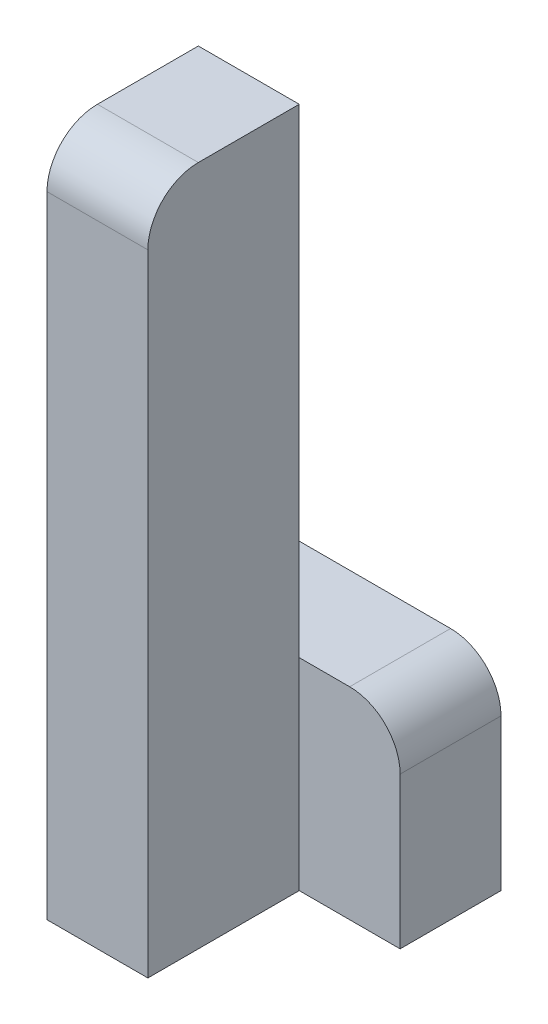
ISO-10303-21;
HEADER;
FILE_DESCRIPTION(('STEP AP214'),'2;1');
FILE_NAME('part.step','',(''),(''),'','','');
FILE_SCHEMA(('AUTOMOTIVE_DESIGN { 1 0 10303 214 1 1 1 1 }'));
ENDSEC;
DATA;
#1=APPLICATION_CONTEXT('core data for automotive mechanical design processes');
#2=APPLICATION_PROTOCOL_DEFINITION('international standard','automotive_design',2000,#1);
#3=PRODUCT_CONTEXT('',#1,'mechanical');
#4=PRODUCT('Part','Part','',(#3));
#5=PRODUCT_RELATED_PRODUCT_CATEGORY('part','',(#4));
#6=PRODUCT_DEFINITION_FORMATION('','',#4);
#7=PRODUCT_DEFINITION_CONTEXT('part definition',#1,'design');
#8=PRODUCT_DEFINITION('design','',#6,#7);
#9=PRODUCT_DEFINITION_SHAPE('','',#8);
#10=(LENGTH_UNIT() NAMED_UNIT(*) SI_UNIT(.MILLI.,.METRE.));
#11=(NAMED_UNIT(*) PLANE_ANGLE_UNIT() SI_UNIT($,.RADIAN.));
#12=(NAMED_UNIT(*) SI_UNIT($,.STERADIAN.) SOLID_ANGLE_UNIT());
#13=UNCERTAINTY_MEASURE_WITH_UNIT(LENGTH_MEASURE(1.E-05),#10,'distance_accuracy_value','');
#14=(GEOMETRIC_REPRESENTATION_CONTEXT(3) GLOBAL_UNCERTAINTY_ASSIGNED_CONTEXT((#13)) GLOBAL_UNIT_ASSIGNED_CONTEXT((#10,
#11,#12)) REPRESENTATION_CONTEXT('',''));
#15=CARTESIAN_POINT('',(0.,0.,0.));
#16=DIRECTION('',(0.,0.,1.));
#17=DIRECTION('',(1.,0.,0.));
#18=AXIS2_PLACEMENT_3D('',#15,#16,#17);
#19=CARTESIAN_POINT('',(-10.,0.,30.));
#20=DIRECTION('',(0.,-1.,0.));
#21=DIRECTION('',(1.,0.,0.));
#22=AXIS2_PLACEMENT_3D('',#19,#20,#21);
#23=PLANE('',#22);
#24=DIRECTION('',(0.,0.,-1.));
#25=VECTOR('',#24,1.);
#26=CARTESIAN_POINT('',(-30.,0.,30.));
#27=LINE('',#26,#25);
#28=CARTESIAN_POINT('',(-30.,0.,20.));
#29=VERTEX_POINT('',#28);
#30=CARTESIAN_POINT('',(-30.,0.,0.));
#31=VERTEX_POINT('',#30);
#32=EDGE_CURVE('E171',#29,#31,#27,.T.);
#33=ORIENTED_EDGE('',*,*,#32,.F.);
#34=DIRECTION('',(-1.,0.,0.));
#35=VECTOR('',#34,1.);
#36=CARTESIAN_POINT('',(-10.,0.,20.));
#37=LINE('',#36,#35);
#38=CARTESIAN_POINT('',(-10.,0.,20.));
#39=VERTEX_POINT('',#38);
#40=EDGE_CURVE('E43',#29,#39,#37,.F.);
#41=ORIENTED_EDGE('',*,*,#40,.T.);
#42=DIRECTION('',(0.,0.,-1.));
#43=VECTOR('',#42,1.);
#44=CARTESIAN_POINT('',(-10.,0.,30.));
#45=LINE('',#44,#43);
#46=CARTESIAN_POINT('',(-10.,0.,0.));
#47=VERTEX_POINT('',#46);
#48=EDGE_CURVE('E158',#39,#47,#45,.T.);
#49=ORIENTED_EDGE('',*,*,#48,.T.);
#50=DIRECTION('',(-1.,0.,0.));
#51=VECTOR('',#50,1.);
#52=CARTESIAN_POINT('',(-10.,0.,0.));
#53=LINE('',#52,#51);
#54=EDGE_CURVE('E148',#47,#31,#53,.T.);
#55=ORIENTED_EDGE('',*,*,#54,.T.);
#56=EDGE_LOOP('',(#33,#41,#49,#55));
#57=FACE_BOUND('',#56,.T.);
#58=ADVANCED_FACE('F35',(#57),#23,.F.);
#59=CARTESIAN_POINT('',(-30.,0.,30.));
#60=DIRECTION('',(1.,0.,0.));
#61=DIRECTION('',(0.,0.,-1.));
#62=AXIS2_PLACEMENT_3D('',#59,#60,#61);
#63=PLANE('',#62);
#64=DIRECTION('',(0.,-1.,0.));
#65=VECTOR('',#64,1.);
#66=CARTESIAN_POINT('',(-30.,0.,30.));
#67=LINE('',#66,#65);
#68=CARTESIAN_POINT('',(-30.,-10.,30.));
#69=VERTEX_POINT('',#68);
#70=CARTESIAN_POINT('',(-30.,-135.,30.));
#71=VERTEX_POINT('',#70);
#72=EDGE_CURVE('E150',#69,#71,#67,.T.);
#73=ORIENTED_EDGE('',*,*,#72,.F.);
#74=CARTESIAN_POINT('',(-30.,-10.,20.));
#75=DIRECTION('',(1.,0.,0.));
#76=DIRECTION('',(0.,0.,-1.));
#77=AXIS2_PLACEMENT_3D('',#74,#75,#76);
#78=CIRCLE('',#77,10.);
#79=EDGE_CURVE('E57',#69,#29,#78,.F.);
#80=ORIENTED_EDGE('',*,*,#79,.T.);
#81=ORIENTED_EDGE('',*,*,#32,.T.);
#82=DIRECTION('',(0.,-1.,0.));
#83=VECTOR('',#82,1.);
#84=CARTESIAN_POINT('',(-30.,0.,0.));
#85=LINE('',#84,#83);
#86=CARTESIAN_POINT('',(-30.,-95.,0.));
#87=VERTEX_POINT('',#86);
#88=EDGE_CURVE('E126',#31,#87,#85,.T.);
#89=ORIENTED_EDGE('',*,*,#88,.T.);
#90=DIRECTION('',(0.,0.,1.));
#91=VECTOR('',#90,1.);
#92=CARTESIAN_POINT('',(-30.,-95.,-20.));
#93=LINE('',#92,#91);
#94=CARTESIAN_POINT('',(-30.,-95.,-20.));
#95=VERTEX_POINT('',#94);
#96=EDGE_CURVE('E111',#95,#87,#93,.T.);
#97=ORIENTED_EDGE('',*,*,#96,.F.);
#98=DIRECTION('',(0.,-1.,0.));
#99=VECTOR('',#98,1.);
#100=CARTESIAN_POINT('',(-30.,-95.,-20.));
#101=LINE('',#100,#99);
#102=CARTESIAN_POINT('',(-30.,-135.,-20.));
#103=VERTEX_POINT('',#102);
#104=EDGE_CURVE('E118',#95,#103,#101,.T.);
#105=ORIENTED_EDGE('',*,*,#104,.T.);
#106=DIRECTION('',(0.,0.,-1.));
#107=VECTOR('',#106,1.);
#108=CARTESIAN_POINT('',(-30.,-135.,30.));
#109=LINE('',#108,#107);
#110=EDGE_CURVE('E169',#71,#103,#109,.T.);
#111=ORIENTED_EDGE('',*,*,#110,.F.);
#112=EDGE_LOOP('',(#73,#80,#81,#89,#97,#105,#111));
#113=FACE_BOUND('',#112,.T.);
#114=ADVANCED_FACE('F123',(#113),#63,.F.);
#115=CARTESIAN_POINT('',(-30.,-135.,30.));
#116=DIRECTION('',(0.,1.,0.));
#117=DIRECTION('',(0.,0.,1.));
#118=AXIS2_PLACEMENT_3D('',#115,#116,#117);
#119=PLANE('',#118);
#120=ORIENTED_EDGE('',*,*,#110,.T.);
#121=DIRECTION('',(1.,0.,0.));
#122=VECTOR('',#121,1.);
#123=CARTESIAN_POINT('',(-30.,-135.,-20.));
#124=LINE('',#123,#122);
#125=CARTESIAN_POINT('',(10.,-135.,-20.));
#126=VERTEX_POINT('',#125);
#127=EDGE_CURVE('E134',#103,#126,#124,.T.);
#128=ORIENTED_EDGE('',*,*,#127,.T.);
#129=DIRECTION('',(0.,0.,1.));
#130=VECTOR('',#129,1.);
#131=CARTESIAN_POINT('',(10.,-135.,-20.));
#132=LINE('',#131,#130);
#133=CARTESIAN_POINT('',(10.,-135.,0.));
#134=VERTEX_POINT('',#133);
#135=EDGE_CURVE('E127',#126,#134,#132,.T.);
#136=ORIENTED_EDGE('',*,*,#135,.T.);
#137=DIRECTION('',(1.,0.,0.));
#138=VECTOR('',#137,1.);
#139=CARTESIAN_POINT('',(-30.,-135.,0.));
#140=LINE('',#139,#138);
#141=CARTESIAN_POINT('',(-10.,-135.,0.));
#142=VERTEX_POINT('',#141);
#143=EDGE_CURVE('E142',#142,#134,#140,.T.);
#144=ORIENTED_EDGE('',*,*,#143,.F.);
#145=DIRECTION('',(0.,0.,-1.));
#146=VECTOR('',#145,1.);
#147=CARTESIAN_POINT('',(-10.,-135.,30.));
#148=LINE('',#147,#146);
#149=CARTESIAN_POINT('',(-10.,-135.,30.));
#150=VERTEX_POINT('',#149);
#151=EDGE_CURVE('E166',#150,#142,#148,.T.);
#152=ORIENTED_EDGE('',*,*,#151,.F.);
#153=DIRECTION('',(1.,0.,0.));
#154=VECTOR('',#153,1.);
#155=CARTESIAN_POINT('',(-30.,-135.,30.));
#156=LINE('',#155,#154);
#157=EDGE_CURVE('E152',#71,#150,#156,.T.);
#158=ORIENTED_EDGE('',*,*,#157,.F.);
#159=EDGE_LOOP('',(#120,#128,#136,#144,#152,#158));
#160=FACE_BOUND('',#159,.T.);
#161=ADVANCED_FACE('F193',(#160),#119,.F.);
#162=CARTESIAN_POINT('',(-10.,-135.,30.));
#163=DIRECTION('',(-1.,0.,0.));
#164=DIRECTION('',(0.,0.,1.));
#165=AXIS2_PLACEMENT_3D('',#162,#163,#164);
#166=PLANE('',#165);
#167=ORIENTED_EDGE('',*,*,#48,.F.);
#168=CARTESIAN_POINT('',(-10.,-10.,20.));
#169=DIRECTION('',(-1.,0.,0.));
#170=DIRECTION('',(0.,0.,1.));
#171=AXIS2_PLACEMENT_3D('',#168,#169,#170);
#172=CIRCLE('',#171,10.);
#173=CARTESIAN_POINT('',(-10.,-10.,30.));
#174=VERTEX_POINT('',#173);
#175=EDGE_CURVE('E11',#39,#174,#172,.F.);
#176=ORIENTED_EDGE('',*,*,#175,.T.);
#177=DIRECTION('',(0.,1.,0.));
#178=VECTOR('',#177,1.);
#179=CARTESIAN_POINT('',(-10.,-135.,30.));
#180=LINE('',#179,#178);
#181=EDGE_CURVE('E155',#150,#174,#180,.T.);
#182=ORIENTED_EDGE('',*,*,#181,.F.);
#183=ORIENTED_EDGE('',*,*,#151,.T.);
#184=DIRECTION('',(0.,1.,0.));
#185=VECTOR('',#184,1.);
#186=CARTESIAN_POINT('',(-10.,-135.,0.));
#187=LINE('',#186,#185);
#188=CARTESIAN_POINT('',(-10.,-95.,0.));
#189=VERTEX_POINT('',#188);
#190=EDGE_CURVE('E153',#142,#189,#187,.T.);
#191=ORIENTED_EDGE('',*,*,#190,.T.);
#192=EDGE_CURVE('E162',#189,#47,#187,.T.);
#193=ORIENTED_EDGE('',*,*,#192,.T.);
#194=EDGE_LOOP('',(#167,#176,#182,#183,#191,#193));
#195=FACE_BOUND('',#194,.T.);
#196=ADVANCED_FACE('F196',(#195),#166,.F.);
#197=CARTESIAN_POINT('',(0.,0.,30.));
#198=DIRECTION('',(0.,0.,1.));
#199=DIRECTION('',(1.,0.,0.));
#200=AXIS2_PLACEMENT_3D('',#197,#198,#199);
#201=PLANE('',#200);
#202=ORIENTED_EDGE('',*,*,#181,.T.);
#203=DIRECTION('',(-1.,0.,0.));
#204=VECTOR('',#203,1.);
#205=CARTESIAN_POINT('',(-30.,-10.,30.));
#206=LINE('',#205,#204);
#207=EDGE_CURVE('E181',#174,#69,#206,.T.);
#208=ORIENTED_EDGE('',*,*,#207,.T.);
#209=ORIENTED_EDGE('',*,*,#72,.T.);
#210=ORIENTED_EDGE('',*,*,#157,.T.);
#211=EDGE_LOOP('',(#202,#208,#209,#210));
#212=FACE_BOUND('',#211,.T.);
#213=ADVANCED_FACE('F186',(#212),#201,.T.);
#214=CARTESIAN_POINT('',(0.,0.,0.));
#215=DIRECTION('',(0.,0.,1.));
#216=DIRECTION('',(1.,0.,0.));
#217=AXIS2_PLACEMENT_3D('',#214,#215,#216);
#218=PLANE('',#217);
#219=ORIENTED_EDGE('',*,*,#192,.F.);
#220=DIRECTION('',(-1.,0.,0.));
#221=VECTOR('',#220,1.);
#222=CARTESIAN_POINT('',(10.,-95.,0.));
#223=LINE('',#222,#221);
#224=EDGE_CURVE('E143',#189,#87,#223,.T.);
#225=ORIENTED_EDGE('',*,*,#224,.T.);
#226=ORIENTED_EDGE('',*,*,#88,.F.);
#227=ORIENTED_EDGE('',*,*,#54,.F.);
#228=EDGE_LOOP('',(#219,#225,#226,#227));
#229=FACE_BOUND('',#228,.T.);
#230=ADVANCED_FACE('F215',(#229),#218,.F.);
#231=CARTESIAN_POINT('',(0.,0.,0.));
#232=DIRECTION('',(0.,0.,1.));
#233=DIRECTION('',(1.,0.,0.));
#234=AXIS2_PLACEMENT_3D('',#231,#232,#233);
#235=PLANE('',#234);
#236=DIRECTION('',(0.,1.,0.));
#237=VECTOR('',#236,1.);
#238=CARTESIAN_POINT('',(10.,-135.,0.));
#239=LINE('',#238,#237);
#240=CARTESIAN_POINT('',(10.,-105.,0.));
#241=VERTEX_POINT('',#240);
#242=EDGE_CURVE('E119',#134,#241,#239,.T.);
#243=ORIENTED_EDGE('',*,*,#242,.T.);
#244=CARTESIAN_POINT('',(0.,-105.,0.));
#245=DIRECTION('',(0.,0.,1.));
#246=DIRECTION('',(1.,0.,0.));
#247=AXIS2_PLACEMENT_3D('',#244,#245,#246);
#248=CIRCLE('',#247,10.);
#249=CARTESIAN_POINT('',(0.,-95.,0.));
#250=VERTEX_POINT('',#249);
#251=EDGE_CURVE('E176',#241,#250,#248,.T.);
#252=ORIENTED_EDGE('',*,*,#251,.T.);
#253=EDGE_CURVE('E140',#250,#189,#223,.T.);
#254=ORIENTED_EDGE('',*,*,#253,.T.);
#255=ORIENTED_EDGE('',*,*,#190,.F.);
#256=ORIENTED_EDGE('',*,*,#143,.T.);
#257=EDGE_LOOP('',(#243,#252,#254,#255,#256));
#258=FACE_BOUND('',#257,.T.);
#259=ADVANCED_FACE('F218',(#258),#235,.T.);
#260=CARTESIAN_POINT('',(10.,-95.,-20.));
#261=DIRECTION('',(0.,1.,0.));
#262=DIRECTION('',(0.,0.,1.));
#263=AXIS2_PLACEMENT_3D('',#260,#261,#262);
#264=PLANE('',#263);
#265=ORIENTED_EDGE('',*,*,#253,.F.);
#266=DIRECTION('',(0.,0.,1.));
#267=VECTOR('',#266,1.);
#268=CARTESIAN_POINT('',(0.,-95.,-20.));
#269=LINE('',#268,#267);
#270=CARTESIAN_POINT('',(0.,-95.,-20.));
#271=VERTEX_POINT('',#270);
#272=EDGE_CURVE('E114',#250,#271,#269,.F.);
#273=ORIENTED_EDGE('',*,*,#272,.T.);
#274=DIRECTION('',(-1.,0.,0.));
#275=VECTOR('',#274,1.);
#276=CARTESIAN_POINT('',(10.,-95.,-20.));
#277=LINE('',#276,#275);
#278=EDGE_CURVE('E106',#271,#95,#277,.T.);
#279=ORIENTED_EDGE('',*,*,#278,.T.);
#280=ORIENTED_EDGE('',*,*,#96,.T.);
#281=ORIENTED_EDGE('',*,*,#224,.F.);
#282=EDGE_LOOP('',(#265,#273,#279,#280,#281));
#283=FACE_BOUND('',#282,.T.);
#284=ADVANCED_FACE('F109',(#283),#264,.T.);
#285=CARTESIAN_POINT('',(10.,-135.,-20.));
#286=DIRECTION('',(1.,0.,0.));
#287=DIRECTION('',(0.,0.,-1.));
#288=AXIS2_PLACEMENT_3D('',#285,#286,#287);
#289=PLANE('',#288);
#290=DIRECTION('',(0.,1.,0.));
#291=VECTOR('',#290,1.);
#292=CARTESIAN_POINT('',(10.,-135.,-20.));
#293=LINE('',#292,#291);
#294=CARTESIAN_POINT('',(10.,-105.,-20.));
#295=VERTEX_POINT('',#294);
#296=EDGE_CURVE('E128',#126,#295,#293,.T.);
#297=ORIENTED_EDGE('',*,*,#296,.T.);
#298=DIRECTION('',(0.,0.,1.));
#299=VECTOR('',#298,1.);
#300=CARTESIAN_POINT('',(10.,-105.,-20.));
#301=LINE('',#300,#299);
#302=EDGE_CURVE('E173',#295,#241,#301,.T.);
#303=ORIENTED_EDGE('',*,*,#302,.T.);
#304=ORIENTED_EDGE('',*,*,#242,.F.);
#305=ORIENTED_EDGE('',*,*,#135,.F.);
#306=EDGE_LOOP('',(#297,#303,#304,#305));
#307=FACE_BOUND('',#306,.T.);
#308=ADVANCED_FACE('F224',(#307),#289,.T.);
#309=CARTESIAN_POINT('',(0.,0.,-20.));
#310=DIRECTION('',(0.,0.,1.));
#311=DIRECTION('',(1.,0.,0.));
#312=AXIS2_PLACEMENT_3D('',#309,#310,#311);
#313=PLANE('',#312);
#314=ORIENTED_EDGE('',*,*,#278,.F.);
#315=CARTESIAN_POINT('',(0.,-105.,-20.));
#316=DIRECTION('',(0.,0.,1.));
#317=DIRECTION('',(1.,0.,0.));
#318=AXIS2_PLACEMENT_3D('',#315,#316,#317);
#319=CIRCLE('',#318,10.);
#320=EDGE_CURVE('E179',#271,#295,#319,.F.);
#321=ORIENTED_EDGE('',*,*,#320,.T.);
#322=ORIENTED_EDGE('',*,*,#296,.F.);
#323=ORIENTED_EDGE('',*,*,#127,.F.);
#324=ORIENTED_EDGE('',*,*,#104,.F.);
#325=EDGE_LOOP('',(#314,#321,#322,#323,#324));
#326=FACE_BOUND('',#325,.T.);
#327=ADVANCED_FACE('F131',(#326),#313,.F.);
#328=CARTESIAN_POINT('',(0.,-105.,-20.));
#329=DIRECTION('',(0.,0.,1.));
#330=DIRECTION('',(1.,0.,0.));
#331=AXIS2_PLACEMENT_3D('',#328,#329,#330);
#332=CYLINDRICAL_SURFACE('',#331,10.);
#333=ORIENTED_EDGE('',*,*,#320,.F.);
#334=ORIENTED_EDGE('',*,*,#272,.F.);
#335=ORIENTED_EDGE('',*,*,#251,.F.);
#336=ORIENTED_EDGE('',*,*,#302,.F.);
#337=EDGE_LOOP('',(#333,#334,#335,#336));
#338=FACE_BOUND('',#337,.T.);
#339=ADVANCED_FACE('F199',(#338),#332,.T.);
#340=CARTESIAN_POINT('',(0.,-10.,20.));
#341=DIRECTION('',(1.,0.,0.));
#342=DIRECTION('',(0.,1.,0.));
#343=AXIS2_PLACEMENT_3D('',#340,#341,#342);
#344=CYLINDRICAL_SURFACE('',#343,10.);
#345=ORIENTED_EDGE('',*,*,#175,.F.);
#346=ORIENTED_EDGE('',*,*,#40,.F.);
#347=ORIENTED_EDGE('',*,*,#79,.F.);
#348=ORIENTED_EDGE('',*,*,#207,.F.);
#349=EDGE_LOOP('',(#345,#346,#347,#348));
#350=FACE_BOUND('',#349,.T.);
#351=ADVANCED_FACE('F37',(#350),#344,.T.);
#352=CLOSED_SHELL('',(#58,#114,#161,#196,#213,#230,#259,#284,#308,#327,#339,#351));
#353=MANIFOLD_SOLID_BREP('B2',#352);
#354=ADVANCED_BREP_SHAPE_REPRESENTATION('',(#18,#353),#14);
#355=SHAPE_DEFINITION_REPRESENTATION(#9,#354);
ENDSEC;
END-ISO-10303-21;
